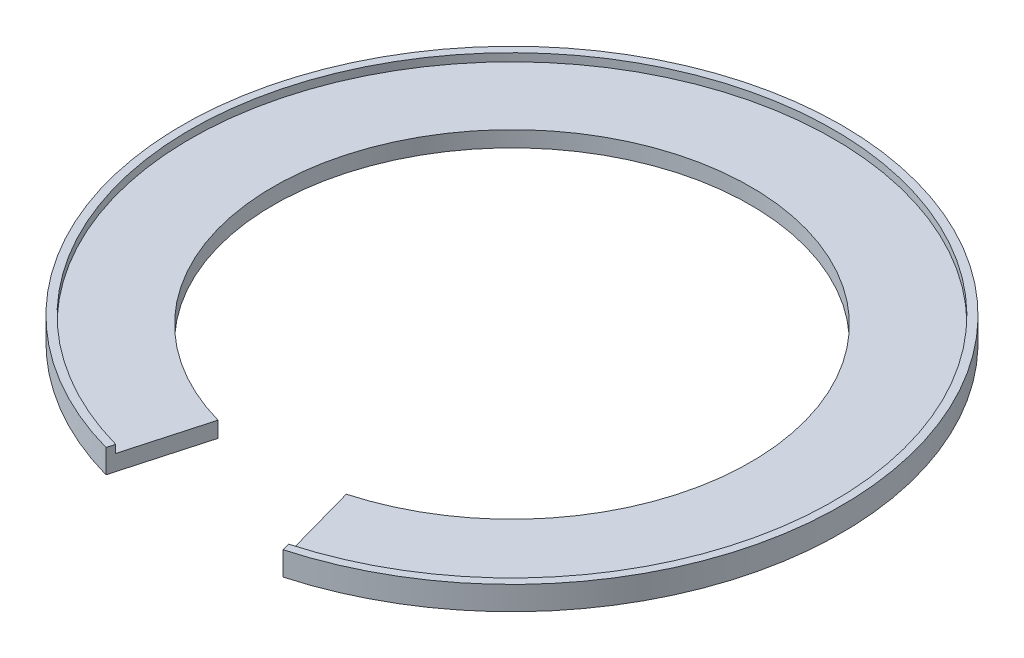
ISO-10303-21;
HEADER;
FILE_DESCRIPTION(('STEP AP214'),'2;1');
FILE_NAME('part.step','',(''),(''),'','','');
FILE_SCHEMA(('AUTOMOTIVE_DESIGN { 1 0 10303 214 1 1 1 1 }'));
ENDSEC;
DATA;
#1=APPLICATION_CONTEXT('core data for automotive mechanical design processes');
#2=APPLICATION_PROTOCOL_DEFINITION('international standard','automotive_design',2000,#1);
#3=PRODUCT_CONTEXT('',#1,'mechanical');
#4=PRODUCT('Part','Part','',(#3));
#5=PRODUCT_RELATED_PRODUCT_CATEGORY('part','',(#4));
#6=PRODUCT_DEFINITION_FORMATION('','',#4);
#7=PRODUCT_DEFINITION_CONTEXT('part definition',#1,'design');
#8=PRODUCT_DEFINITION('design','',#6,#7);
#9=PRODUCT_DEFINITION_SHAPE('','',#8);
#10=(LENGTH_UNIT() NAMED_UNIT(*) SI_UNIT(.MILLI.,.METRE.));
#11=(NAMED_UNIT(*) PLANE_ANGLE_UNIT() SI_UNIT($,.RADIAN.));
#12=(NAMED_UNIT(*) SI_UNIT($,.STERADIAN.) SOLID_ANGLE_UNIT());
#13=UNCERTAINTY_MEASURE_WITH_UNIT(LENGTH_MEASURE(1.E-05),#10,'distance_accuracy_value','');
#14=(GEOMETRIC_REPRESENTATION_CONTEXT(3) GLOBAL_UNCERTAINTY_ASSIGNED_CONTEXT((#13)) GLOBAL_UNIT_ASSIGNED_CONTEXT((#10,
#11,#12)) REPRESENTATION_CONTEXT('',''));
#15=CARTESIAN_POINT('',(0.,0.,0.));
#16=DIRECTION('',(0.,0.,1.));
#17=DIRECTION('',(1.,0.,0.));
#18=AXIS2_PLACEMENT_3D('',#15,#16,#17);
#19=CARTESIAN_POINT('',(0.,2.,0.));
#20=DIRECTION('',(0.,1.,0.));
#21=DIRECTION('',(0.,0.,1.));
#22=AXIS2_PLACEMENT_3D('',#19,#20,#21);
#23=PLANE('',#22);
#24=DIRECTION('',(-0.268722046029711,0.,0.963217764567082));
#25=VECTOR('',#24,1.);
#26=CARTESIAN_POINT('',(0.,2.,0.));
#27=LINE('',#26,#25);
#28=CARTESIAN_POINT('',(-8.12303616918208,2.,29.1165271178086));
#29=VERTEX_POINT('',#28);
#30=CARTESIAN_POINT('',(-10.9504233757107,2.,39.2511239061086));
#31=VERTEX_POINT('',#30);
#32=EDGE_CURVE('E47',#29,#31,#27,.T.);
#33=ORIENTED_EDGE('',*,*,#32,.F.);
#34=CARTESIAN_POINT('',(0.,2.,0.));
#35=DIRECTION('',(0.,1.,0.));
#36=DIRECTION('',(0.,0.,1.));
#37=AXIS2_PLACEMENT_3D('',#34,#35,#36);
#38=CIRCLE('',#37,30.2283950617284);
#39=CARTESIAN_POINT('',(8.12303616918166,2.,29.1165271178087));
#40=VERTEX_POINT('',#39);
#41=EDGE_CURVE('E108',#40,#29,#38,.T.);
#42=ORIENTED_EDGE('',*,*,#41,.F.);
#43=DIRECTION('',(-0.268722046029698,0.,-0.963217764567085));
#44=VECTOR('',#43,1.);
#45=CARTESIAN_POINT('',(0.,2.,0.));
#46=LINE('',#45,#44);
#47=CARTESIAN_POINT('',(10.9504233757102,2.,39.2511239061087));
#48=VERTEX_POINT('',#47);
#49=EDGE_CURVE('E120',#48,#40,#46,.T.);
#50=ORIENTED_EDGE('',*,*,#49,.F.);
#51=CARTESIAN_POINT('',(0.,2.,0.));
#52=DIRECTION('',(0.,1.,0.));
#53=DIRECTION('',(0.,0.,1.));
#54=AXIS2_PLACEMENT_3D('',#51,#52,#53);
#55=CIRCLE('',#54,40.75);
#56=EDGE_CURVE('E117',#31,#48,#55,.F.);
#57=ORIENTED_EDGE('',*,*,#56,.F.);
#58=EDGE_LOOP('',(#33,#42,#50,#57));
#59=FACE_BOUND('',#58,.T.);
#60=ADVANCED_FACE('F33',(#59),#23,.T.);
#61=CARTESIAN_POINT('',(0.,0.,0.));
#62=DIRECTION('',(0.,1.,0.));
#63=DIRECTION('',(0.,0.,1.));
#64=AXIS2_PLACEMENT_3D('',#61,#62,#63);
#65=PLANE('',#64);
#66=CARTESIAN_POINT('',(0.,0.,0.));
#67=DIRECTION('',(0.,1.,0.));
#68=DIRECTION('',(0.,0.,1.));
#69=AXIS2_PLACEMENT_3D('',#66,#67,#68);
#70=CIRCLE('',#69,30.2283950617284);
#71=CARTESIAN_POINT('',(8.12303616918166,0.,29.1165271178088));
#72=VERTEX_POINT('',#71);
#73=CARTESIAN_POINT('',(-8.12303616918208,0.,29.1165271178086));
#74=VERTEX_POINT('',#73);
#75=EDGE_CURVE('E105',#72,#74,#70,.T.);
#76=ORIENTED_EDGE('',*,*,#75,.T.);
#77=DIRECTION('',(-0.268722046029711,0.,0.963217764567082));
#78=VECTOR('',#77,1.);
#79=CARTESIAN_POINT('',(-7.92730035787648,0.,28.4149240547289));
#80=LINE('',#79,#78);
#81=CARTESIAN_POINT('',(-11.2191454217404,0.,40.2143416706757));
#82=VERTEX_POINT('',#81);
#83=EDGE_CURVE('E126',#74,#82,#80,.T.);
#84=ORIENTED_EDGE('',*,*,#83,.T.);
#85=CARTESIAN_POINT('',(0.,0.,0.));
#86=DIRECTION('',(0.,1.,0.));
#87=DIRECTION('',(0.,0.,1.));
#88=AXIS2_PLACEMENT_3D('',#85,#86,#87);
#89=CIRCLE('',#88,41.75);
#90=CARTESIAN_POINT('',(11.2191454217399,0.,40.2143416706758));
#91=VERTEX_POINT('',#90);
#92=EDGE_CURVE('E114',#91,#82,#89,.T.);
#93=ORIENTED_EDGE('',*,*,#92,.F.);
#94=DIRECTION('',(-0.268722046029698,0.,-0.963217764567085));
#95=VECTOR('',#94,1.);
#96=CARTESIAN_POINT('',(12.2931393192898,0.,44.0640072133473));
#97=LINE('',#96,#95);
#98=EDGE_CURVE('E86',#91,#72,#97,.T.);
#99=ORIENTED_EDGE('',*,*,#98,.T.);
#100=EDGE_LOOP('',(#76,#84,#93,#99));
#101=FACE_BOUND('',#100,.T.);
#102=ADVANCED_FACE('F143',(#101),#65,.F.);
#103=CARTESIAN_POINT('',(0.,2.,0.));
#104=DIRECTION('',(0.,-1.,0.));
#105=DIRECTION('',(0.,0.,-1.));
#106=AXIS2_PLACEMENT_3D('',#103,#104,#105);
#107=CYLINDRICAL_SURFACE('',#106,41.75);
#108=ORIENTED_EDGE('',*,*,#92,.T.);
#109=DIRECTION('',(0.,-1.,0.));
#110=VECTOR('',#109,1.);
#111=CARTESIAN_POINT('',(-11.2191454217404,2.,40.2143416706757));
#112=LINE('',#111,#110);
#113=CARTESIAN_POINT('',(-11.2191454217404,3.,40.2143416706757));
#114=VERTEX_POINT('',#113);
#115=EDGE_CURVE('E104',#82,#114,#112,.F.);
#116=ORIENTED_EDGE('',*,*,#115,.T.);
#117=CARTESIAN_POINT('',(0.,3.,0.));
#118=DIRECTION('',(0.,1.,0.));
#119=DIRECTION('',(0.,0.,1.));
#120=AXIS2_PLACEMENT_3D('',#117,#118,#119);
#121=CIRCLE('',#120,41.75);
#122=CARTESIAN_POINT('',(11.2191454217399,3.,40.2143416706758));
#123=VERTEX_POINT('',#122);
#124=EDGE_CURVE('E98',#123,#114,#121,.T.);
#125=ORIENTED_EDGE('',*,*,#124,.F.);
#126=DIRECTION('',(0.,-1.,0.));
#127=VECTOR('',#126,1.);
#128=CARTESIAN_POINT('',(11.2191454217399,2.,40.2143416706758));
#129=LINE('',#128,#127);
#130=EDGE_CURVE('E83',#123,#91,#129,.T.);
#131=ORIENTED_EDGE('',*,*,#130,.T.);
#132=EDGE_LOOP('',(#108,#116,#125,#131));
#133=FACE_BOUND('',#132,.T.);
#134=ADVANCED_FACE('F35',(#133),#107,.T.);
#135=CARTESIAN_POINT('',(0.,2.,0.));
#136=DIRECTION('',(0.,-1.,0.));
#137=DIRECTION('',(0.,0.,-1.));
#138=AXIS2_PLACEMENT_3D('',#135,#136,#137);
#139=CYLINDRICAL_SURFACE('',#138,30.2283950617284);
#140=DIRECTION('',(0.,-1.,0.));
#141=VECTOR('',#140,1.);
#142=CARTESIAN_POINT('',(-8.12303616918208,2.,29.1165271178086));
#143=LINE('',#142,#141);
#144=EDGE_CURVE('E137',#74,#29,#143,.F.);
#145=ORIENTED_EDGE('',*,*,#144,.F.);
#146=ORIENTED_EDGE('',*,*,#75,.F.);
#147=DIRECTION('',(0.,-1.,0.));
#148=VECTOR('',#147,1.);
#149=CARTESIAN_POINT('',(8.12303616918166,2.,29.1165271178088));
#150=LINE('',#149,#148);
#151=EDGE_CURVE('E91',#40,#72,#150,.T.);
#152=ORIENTED_EDGE('',*,*,#151,.F.);
#153=ORIENTED_EDGE('',*,*,#41,.T.);
#154=EDGE_LOOP('',(#145,#146,#152,#153));
#155=FACE_BOUND('',#154,.T.);
#156=ADVANCED_FACE('F141',(#155),#139,.F.);
#157=CARTESIAN_POINT('',(0.,3.,0.));
#158=DIRECTION('',(0.,1.,0.));
#159=DIRECTION('',(0.,0.,1.));
#160=AXIS2_PLACEMENT_3D('',#157,#158,#159);
#161=PLANE('',#160);
#162=DIRECTION('',(-0.268722046029711,0.,0.963217764567082));
#163=VECTOR('',#162,1.);
#164=CARTESIAN_POINT('',(-7.92730035787648,3.,28.4149240547289));
#165=LINE('',#164,#163);
#166=CARTESIAN_POINT('',(-10.9504233757107,3.,39.2511239061086));
#167=VERTEX_POINT('',#166);
#168=EDGE_CURVE('E101',#167,#114,#165,.T.);
#169=ORIENTED_EDGE('',*,*,#168,.F.);
#170=CARTESIAN_POINT('',(0.,3.,0.));
#171=DIRECTION('',(0.,1.,0.));
#172=DIRECTION('',(0.,0.,1.));
#173=AXIS2_PLACEMENT_3D('',#170,#171,#172);
#174=CIRCLE('',#173,40.75);
#175=CARTESIAN_POINT('',(10.9504233757102,3.,39.2511239061087));
#176=VERTEX_POINT('',#175);
#177=EDGE_CURVE('E100',#176,#167,#174,.T.);
#178=ORIENTED_EDGE('',*,*,#177,.F.);
#179=DIRECTION('',(-0.268722046029698,0.,-0.963217764567085));
#180=VECTOR('',#179,1.);
#181=CARTESIAN_POINT('',(12.2931393192898,3.,44.0640072133473));
#182=LINE('',#181,#180);
#183=EDGE_CURVE('E55',#123,#176,#182,.T.);
#184=ORIENTED_EDGE('',*,*,#183,.F.);
#185=ORIENTED_EDGE('',*,*,#124,.T.);
#186=EDGE_LOOP('',(#169,#178,#184,#185));
#187=FACE_BOUND('',#186,.T.);
#188=ADVANCED_FACE('F97',(#187),#161,.T.);
#189=CARTESIAN_POINT('',(0.,3.,0.));
#190=DIRECTION('',(0.,-1.,0.));
#191=DIRECTION('',(0.,0.,-1.));
#192=AXIS2_PLACEMENT_3D('',#189,#190,#191);
#193=CYLINDRICAL_SURFACE('',#192,40.75);
#194=DIRECTION('',(0.,-1.,0.));
#195=VECTOR('',#194,1.);
#196=CARTESIAN_POINT('',(-10.9504233757107,3.,39.2511239061086));
#197=LINE('',#196,#195);
#198=EDGE_CURVE('E11',#31,#167,#197,.F.);
#199=ORIENTED_EDGE('',*,*,#198,.F.);
#200=ORIENTED_EDGE('',*,*,#56,.T.);
#201=DIRECTION('',(0.,-1.,0.));
#202=VECTOR('',#201,1.);
#203=CARTESIAN_POINT('',(10.9504233757102,3.,39.2511239061087));
#204=LINE('',#203,#202);
#205=EDGE_CURVE('E41',#176,#48,#204,.T.);
#206=ORIENTED_EDGE('',*,*,#205,.F.);
#207=ORIENTED_EDGE('',*,*,#177,.T.);
#208=EDGE_LOOP('',(#199,#200,#206,#207));
#209=FACE_BOUND('',#208,.T.);
#210=ADVANCED_FACE('F128',(#209),#193,.F.);
#211=CARTESIAN_POINT('',(12.2931393192898,0.,44.0640072133473));
#212=DIRECTION('',(0.963217764567086,0.,-0.268722046029698));
#213=DIRECTION('',(-0.268722046029698,0.,-0.963217764567085));
#214=AXIS2_PLACEMENT_3D('',#211,#212,#213);
#215=PLANE('',#214);
#216=ORIENTED_EDGE('',*,*,#183,.T.);
#217=ORIENTED_EDGE('',*,*,#205,.T.);
#218=ORIENTED_EDGE('',*,*,#49,.T.);
#219=ORIENTED_EDGE('',*,*,#151,.T.);
#220=ORIENTED_EDGE('',*,*,#98,.F.);
#221=ORIENTED_EDGE('',*,*,#130,.F.);
#222=EDGE_LOOP('',(#216,#217,#218,#219,#220,#221));
#223=FACE_BOUND('',#222,.T.);
#224=ADVANCED_FACE('F84',(#223),#215,.F.);
#225=CARTESIAN_POINT('',(-7.92730035787648,0.,28.4149240547289));
#226=DIRECTION('',(-0.963217764567082,0.,-0.268722046029711));
#227=DIRECTION('',(-0.268722046029711,0.,0.963217764567082));
#228=AXIS2_PLACEMENT_3D('',#225,#226,#227);
#229=PLANE('',#228);
#230=ORIENTED_EDGE('',*,*,#83,.F.);
#231=ORIENTED_EDGE('',*,*,#144,.T.);
#232=ORIENTED_EDGE('',*,*,#32,.T.);
#233=ORIENTED_EDGE('',*,*,#198,.T.);
#234=ORIENTED_EDGE('',*,*,#168,.T.);
#235=ORIENTED_EDGE('',*,*,#115,.F.);
#236=EDGE_LOOP('',(#230,#231,#232,#233,#234,#235));
#237=FACE_BOUND('',#236,.T.);
#238=ADVANCED_FACE('F129',(#237),#229,.F.);
#239=CLOSED_SHELL('',(#60,#102,#134,#156,#188,#210,#224,#238));
#240=MANIFOLD_SOLID_BREP('B2',#239);
#241=ADVANCED_BREP_SHAPE_REPRESENTATION('',(#18,#240),#14);
#242=SHAPE_DEFINITION_REPRESENTATION(#9,#241);
ENDSEC;
END-ISO-10303-21;
